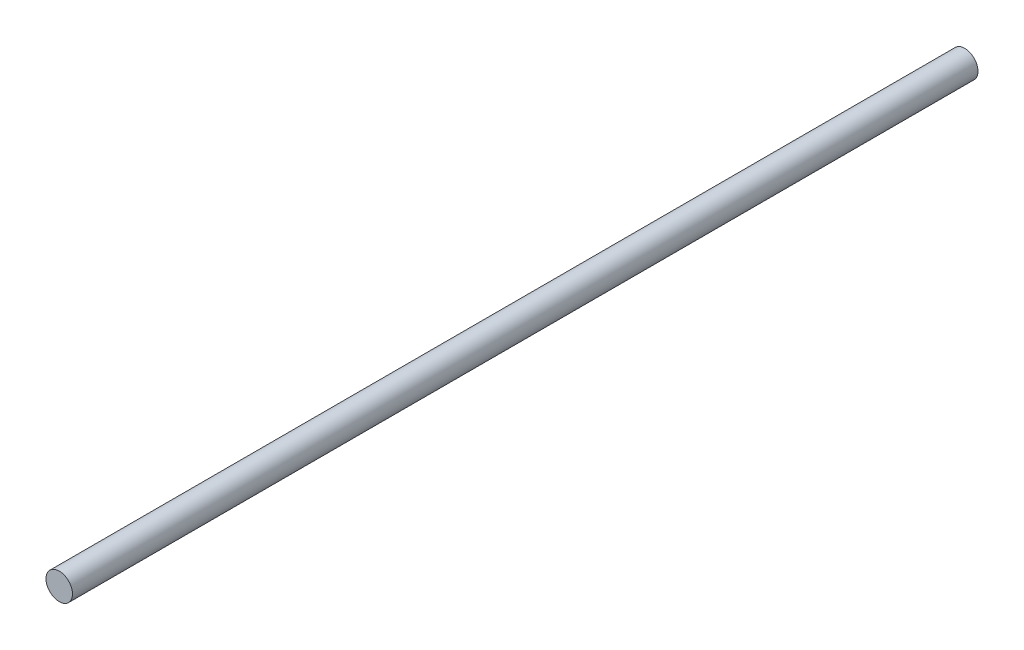
ISO-10303-21;
HEADER;
FILE_DESCRIPTION(('STEP AP214'),'2;1');
FILE_NAME('part.step','',(''),(''),'','','');
FILE_SCHEMA(('AUTOMOTIVE_DESIGN { 1 0 10303 214 1 1 1 1 }'));
ENDSEC;
DATA;
#1=APPLICATION_CONTEXT('core data for automotive mechanical design processes');
#2=APPLICATION_PROTOCOL_DEFINITION('international standard','automotive_design',2000,#1);
#3=PRODUCT_CONTEXT('',#1,'mechanical');
#4=PRODUCT('Part','Part','',(#3));
#5=PRODUCT_RELATED_PRODUCT_CATEGORY('part','',(#4));
#6=PRODUCT_DEFINITION_FORMATION('','',#4);
#7=PRODUCT_DEFINITION_CONTEXT('part definition',#1,'design');
#8=PRODUCT_DEFINITION('design','',#6,#7);
#9=PRODUCT_DEFINITION_SHAPE('','',#8);
#10=(LENGTH_UNIT() NAMED_UNIT(*) SI_UNIT(.MILLI.,.METRE.));
#11=(NAMED_UNIT(*) PLANE_ANGLE_UNIT() SI_UNIT($,.RADIAN.));
#12=(NAMED_UNIT(*) SI_UNIT($,.STERADIAN.) SOLID_ANGLE_UNIT());
#13=UNCERTAINTY_MEASURE_WITH_UNIT(LENGTH_MEASURE(1.E-05),#10,'distance_accuracy_value','');
#14=(GEOMETRIC_REPRESENTATION_CONTEXT(3) GLOBAL_UNCERTAINTY_ASSIGNED_CONTEXT((#13)) GLOBAL_UNIT_ASSIGNED_CONTEXT((#10,
#11,#12)) REPRESENTATION_CONTEXT('',''));
#15=CARTESIAN_POINT('',(0.,0.,0.));
#16=DIRECTION('',(0.,0.,1.));
#17=DIRECTION('',(1.,0.,0.));
#18=AXIS2_PLACEMENT_3D('',#15,#16,#17);
#19=CARTESIAN_POINT('',(0.,0.,410.));
#20=DIRECTION('',(0.,0.,-1.));
#21=DIRECTION('',(-1.,0.,0.));
#22=AXIS2_PLACEMENT_3D('',#19,#20,#21);
#23=CYLINDRICAL_SURFACE('',#22,6.);
#24=CARTESIAN_POINT('',(0.,0.,410.));
#25=DIRECTION('',(0.,0.,1.));
#26=DIRECTION('',(1.,0.,0.));
#27=AXIS2_PLACEMENT_3D('',#24,#25,#26);
#28=CIRCLE('',#27,6.);
#29=CARTESIAN_POINT('',(6.,0.,410.));
#30=VERTEX_POINT('',#29);
#31=EDGE_CURVE('E10',#30,#30,#28,.T.);
#32=ORIENTED_EDGE('',*,*,#31,.F.);
#33=EDGE_LOOP('',(#32));
#34=FACE_BOUND('',#33,.T.);
#35=CARTESIAN_POINT('',(0.,0.,0.));
#36=DIRECTION('',(0.,0.,1.));
#37=DIRECTION('',(1.,0.,0.));
#38=AXIS2_PLACEMENT_3D('',#35,#36,#37);
#39=CIRCLE('',#38,6.);
#40=CARTESIAN_POINT('',(6.,0.,0.));
#41=VERTEX_POINT('',#40);
#42=EDGE_CURVE('E34',#41,#41,#39,.T.);
#43=ORIENTED_EDGE('',*,*,#42,.T.);
#44=EDGE_LOOP('',(#43));
#45=FACE_BOUND('',#44,.T.);
#46=ADVANCED_FACE('F31',(#34,#45),#23,.T.);
#47=CARTESIAN_POINT('',(0.,0.,410.));
#48=DIRECTION('',(0.,0.,1.));
#49=DIRECTION('',(1.,0.,0.));
#50=AXIS2_PLACEMENT_3D('',#47,#48,#49);
#51=PLANE('',#50);
#52=ORIENTED_EDGE('',*,*,#31,.T.);
#53=EDGE_LOOP('',(#52));
#54=FACE_BOUND('',#53,.T.);
#55=ADVANCED_FACE('F46',(#54),#51,.T.);
#56=CARTESIAN_POINT('',(0.,0.,0.));
#57=DIRECTION('',(0.,0.,1.));
#58=DIRECTION('',(1.,0.,0.));
#59=AXIS2_PLACEMENT_3D('',#56,#57,#58);
#60=PLANE('',#59);
#61=ORIENTED_EDGE('',*,*,#42,.F.);
#62=EDGE_LOOP('',(#61));
#63=FACE_BOUND('',#62,.T.);
#64=ADVANCED_FACE('F44',(#63),#60,.F.);
#65=CLOSED_SHELL('',(#46,#55,#64));
#66=MANIFOLD_SOLID_BREP('B2',#65);
#67=ADVANCED_BREP_SHAPE_REPRESENTATION('',(#18,#66),#14);
#68=SHAPE_DEFINITION_REPRESENTATION(#9,#67);
ENDSEC;
END-ISO-10303-21;
